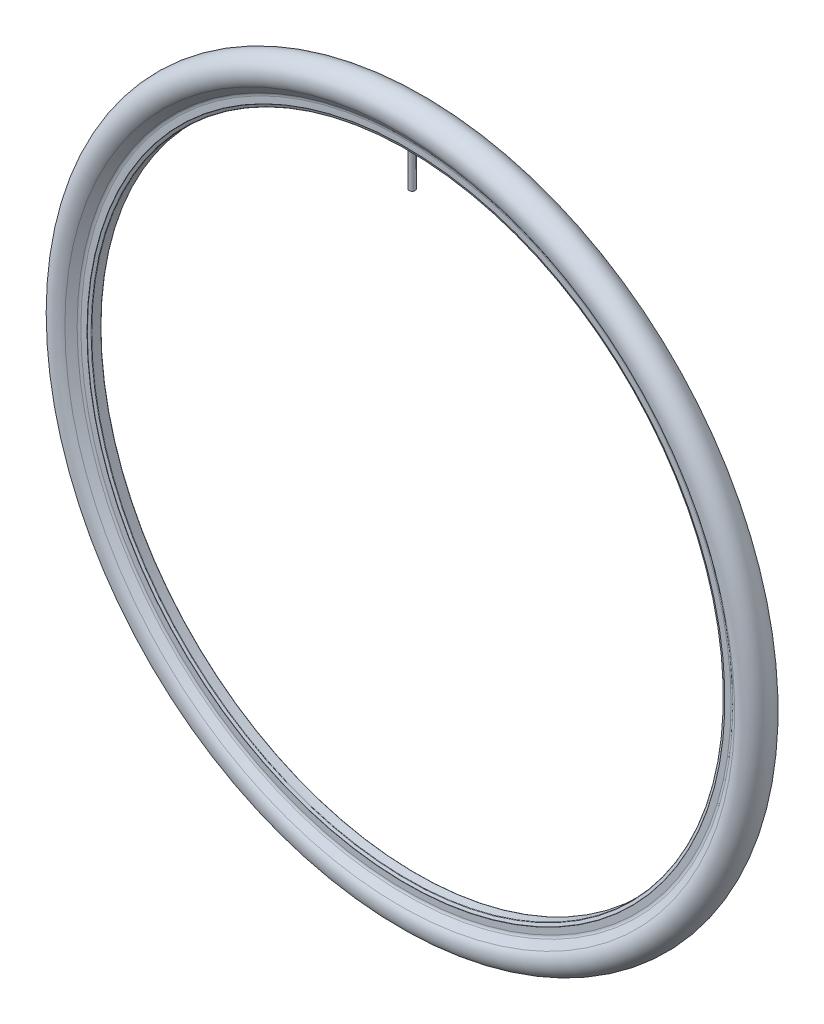
ISO-10303-21;
HEADER;
FILE_DESCRIPTION(('STEP AP214'),'2;1');
FILE_NAME('part.step','',(''),(''),'','','');
FILE_SCHEMA(('AUTOMOTIVE_DESIGN { 1 0 10303 214 1 1 1 1 }'));
ENDSEC;
DATA;
#1=APPLICATION_CONTEXT('core data for automotive mechanical design processes');
#2=APPLICATION_PROTOCOL_DEFINITION('international standard','automotive_design',2000,#1);
#3=PRODUCT_CONTEXT('',#1,'mechanical');
#4=PRODUCT('Part','Part','',(#3));
#5=PRODUCT_RELATED_PRODUCT_CATEGORY('part','',(#4));
#6=PRODUCT_DEFINITION_FORMATION('','',#4);
#7=PRODUCT_DEFINITION_CONTEXT('part definition',#1,'design');
#8=PRODUCT_DEFINITION('design','',#6,#7);
#9=PRODUCT_DEFINITION_SHAPE('','',#8);
#10=(LENGTH_UNIT() NAMED_UNIT(*) SI_UNIT(.MILLI.,.METRE.));
#11=(NAMED_UNIT(*) PLANE_ANGLE_UNIT() SI_UNIT($,.RADIAN.));
#12=(NAMED_UNIT(*) SI_UNIT($,.STERADIAN.) SOLID_ANGLE_UNIT());
#13=UNCERTAINTY_MEASURE_WITH_UNIT(LENGTH_MEASURE(1.E-05),#10,'distance_accuracy_value','');
#14=(GEOMETRIC_REPRESENTATION_CONTEXT(3) GLOBAL_UNCERTAINTY_ASSIGNED_CONTEXT((#13)) GLOBAL_UNIT_ASSIGNED_CONTEXT((#10,
#11,#12)) REPRESENTATION_CONTEXT('',''));
#15=CARTESIAN_POINT('',(0.,0.,0.));
#16=DIRECTION('',(0.,0.,1.));
#17=DIRECTION('',(1.,0.,0.));
#18=AXIS2_PLACEMENT_3D('',#15,#16,#17);
#19=CARTESIAN_POINT('',(0.,0.,-66.4924890033598));
#20=DIRECTION('',(0.,0.,-1.));
#21=DIRECTION('',(-1.,0.,0.));
#22=AXIS2_PLACEMENT_3D('',#19,#20,#21);
#23=CYLINDRICAL_SURFACE('',#22,307.);
#24=CARTESIAN_POINT('',(0.,0.,-4.33166751784149));
#25=DIRECTION('',(0.,0.,-1.));
#26=DIRECTION('',(-1.,0.,0.));
#27=AXIS2_PLACEMENT_3D('',#24,#25,#26);
#28=CIRCLE('',#27,307.);
#29=CARTESIAN_POINT('',(-307.,0.,-4.33166751784141));
#30=VERTEX_POINT('',#29);
#31=EDGE_CURVE('E51',#30,#30,#28,.T.);
#32=ORIENTED_EDGE('',*,*,#31,.T.);
#33=EDGE_LOOP('',(#32));
#34=FACE_BOUND('',#33,.T.);
#35=CARTESIAN_POINT('',(0.,0.,4.33166751784149));
#36=DIRECTION('',(0.,0.,-1.));
#37=DIRECTION('',(-1.,0.,0.));
#38=AXIS2_PLACEMENT_3D('',#35,#36,#37);
#39=CIRCLE('',#38,307.);
#40=CARTESIAN_POINT('',(-307.,0.,4.33166751784158));
#41=VERTEX_POINT('',#40);
#42=EDGE_CURVE('E54',#41,#41,#39,.T.);
#43=ORIENTED_EDGE('',*,*,#42,.F.);
#44=EDGE_LOOP('',(#43));
#45=FACE_BOUND('',#44,.T.);
#46=CARTESIAN_POINT('',(0.,307.,-3.00000000000002));
#47=CARTESIAN_POINT('',(0.168507000842233,306.999999801845,-2.99999252892106));
#48=CARTESIAN_POINT('',(0.337136082730728,306.999859774589,-2.98575505531126));
#49=CARTESIAN_POINT('',(0.669749817537958,306.999314639336,-2.92915668525447));
#50=CARTESIAN_POINT('',(0.833728637064352,306.998909212539,-2.8867619652389));
#51=CARTESIAN_POINT('',(1.15217499523825,306.997879204767,-2.77505636300819));
#52=CARTESIAN_POINT('',(1.30664704757053,306.997254728753,-2.70575837011928));
#53=CARTESIAN_POINT('',(1.60172126722541,306.995857116755,-2.54223112538406));
#54=CARTESIAN_POINT('',(1.74232686485481,306.995084017677,-2.44800806088959));
#55=CARTESIAN_POINT('',(2.00574570718094,306.993476097252,-2.23728296474041));
#56=CARTESIAN_POINT('',(2.12855655686106,306.992641267618,-2.12077793901606));
#57=CARTESIAN_POINT('',(2.35288046629823,306.991004053857,-1.86879875626503));
#58=CARTESIAN_POINT('',(2.45439268841956,306.990201671007,-1.73332385353736));
#59=CARTESIAN_POINT('',(2.63323219880829,306.98871985074,-1.44725361083283));
#60=CARTESIAN_POINT('',(2.71055945400305,306.988040413491,-1.2966582501793));
#61=CARTESIAN_POINT('',(2.83883318995256,306.986881094966,-0.984622373330269));
#62=CARTESIAN_POINT('',(2.88977972934464,306.986401213245,-0.823181881241517));
#63=CARTESIAN_POINT('',(2.96384455342325,306.985695125632,-0.494043519446182));
#64=CARTESIAN_POINT('',(2.98696368616211,306.985468912009,-0.326345840590682));
#65=CARTESIAN_POINT('',(3.00471999192295,306.985295641765,0.010550492687932));
#66=CARTESIAN_POINT('',(2.99935722288316,306.985348584576,0.17974914405705));
#67=CARTESIAN_POINT('',(2.96030281759654,306.985727649641,0.514838648767663));
#68=CARTESIAN_POINT('',(2.92661213896895,306.98605376266,0.680729613730767));
#69=CARTESIAN_POINT('',(2.83185972735208,306.986942387663,1.00450086450579));
#70=CARTESIAN_POINT('',(2.7707979621348,306.987504899924,1.16238114088532));
#71=CARTESIAN_POINT('',(2.62303563967011,306.988802915838,1.46565216865405));
#72=CARTESIAN_POINT('',(2.53633464535241,306.98953842244,1.61104270707697));
#73=CARTESIAN_POINT('',(2.33975540567853,306.991099501789,1.88520468322982));
#74=CARTESIAN_POINT('',(2.22987716308622,306.991925074526,2.01397612294157));
#75=CARTESIAN_POINT('',(1.990057027451,306.993573252124,2.25125018143944));
#76=CARTESIAN_POINT('',(1.86011429310443,306.994395856859,2.35975194989696));
#77=CARTESIAN_POINT('',(1.58385681343715,306.99594532371,2.55340009510425));
#78=CARTESIAN_POINT('',(1.43754206593101,306.996672185812,2.63854646873639));
#79=CARTESIAN_POINT('',(1.13269355382631,306.997948221289,2.78306665458129));
#80=CARTESIAN_POINT('',(0.974159777741514,306.998497394497,2.84244044256674));
#81=CARTESIAN_POINT('',(0.649373714481755,306.999356135141,2.93372948218667));
#82=CARTESIAN_POINT('',(0.483121429846189,306.999665702657,2.96564474285499));
#83=CARTESIAN_POINT('',(0.14762511577715,307.000010322336,3.00110971792454));
#84=CARTESIAN_POINT('',(-0.0216187896043762,307.000045385854,3.00466060574367));
#85=CARTESIAN_POINT('',(-0.358300498127618,306.999837074505,2.98329909141611));
#86=CARTESIAN_POINT('',(-0.52573830141839,306.999593699661,2.9583866916185));
#87=CARTESIAN_POINT('',(-0.854051487374667,306.998855956475,2.88080675771612));
#88=CARTESIAN_POINT('',(-1.01492699534501,306.998361592927,2.8281397538438));
#89=CARTESIAN_POINT('',(-1.3255526435439,306.997177605093,2.69654621550786));
#90=CARTESIAN_POINT('',(-1.47530278269038,306.996487980787,2.61761967849021));
#91=CARTESIAN_POINT('',(-1.75943215021837,306.994991186405,2.43574453892483));
#92=CARTESIAN_POINT('',(-1.89381087390591,306.994184012472,2.33279514796521));
#93=CARTESIAN_POINT('',(-2.14337778701596,306.992543130498,2.10579784037378));
#94=CARTESIAN_POINT('',(-2.25856596430501,306.991709422442,1.98174991040227));
#95=CARTESIAN_POINT('',(-2.46648581307417,306.990109433543,1.71607184045562));
#96=CARTESIAN_POINT('',(-2.55921672206267,306.98934315499,1.57444110373837));
#97=CARTESIAN_POINT('',(-2.71958439522835,306.98796445401,1.27762109125281));
#98=CARTESIAN_POINT('',(-2.78722118909606,306.987352031401,1.12243183152678));
#99=CARTESIAN_POINT('',(-2.89547940567963,306.98635010408,0.802902931610935));
#100=CARTESIAN_POINT('',(-2.93610133009404,306.985960595229,0.638563461412955));
#101=CARTESIAN_POINT('',(-2.98917836882683,306.985448397514,0.305396542807761));
#102=CARTESIAN_POINT('',(-3.00163344038945,306.985325709056,0.136569087588425));
#103=CARTESIAN_POINT('',(-2.99802303601633,306.985360987114,-0.200773177603706));
#104=CARTESIAN_POINT('',(-2.9819588012451,306.985518941417,-0.369288000862793));
#105=CARTESIAN_POINT('',(-2.92176826202349,306.986097671924,-0.701229052921147));
#106=CARTESIAN_POINT('',(-2.87764190121483,306.986518448657,-0.864655271500075));
#107=CARTESIAN_POINT('',(-2.76257897221019,306.987575392849,-1.18178273122479));
#108=CARTESIAN_POINT('',(-2.69164190709221,306.988211564299,-1.33548379205836));
#109=CARTESIAN_POINT('',(-2.52497435541301,306.989627542961,-1.6287892672019));
#110=CARTESIAN_POINT('',(-2.42924483419874,306.99040734458,-1.76839423007929));
#111=CARTESIAN_POINT('',(-2.21571651178069,306.992022643525,-2.0295439071572));
#112=CARTESIAN_POINT('',(-2.09791910047104,306.992858137341,-2.15108975790438));
#113=CARTESIAN_POINT('',(-1.84355621277508,306.99449089547,-2.37271089580679));
#114=CARTESIAN_POINT('',(-1.70698608075206,306.995288150232,-2.47278084111817));
#115=CARTESIAN_POINT('',(-1.41892760124024,306.996754683911,-2.64861190622085));
#116=CARTESIAN_POINT('',(-1.26743189521152,306.997423899218,-2.72436095626323));
#117=CARTESIAN_POINT('',(-0.953991482699,306.998557584721,-2.84926248733127));
#118=CARTESIAN_POINT('',(-0.792059557634327,306.999022300107,-2.89844683492538));
#119=CARTESIAN_POINT('',(-0.524247157695177,306.999569777841,-2.95572196604833));
#120=CARTESIAN_POINT('',(-0.420106675529563,306.999730415627,-2.97230548832878));
#121=CARTESIAN_POINT('',(-0.210660036027182,306.999945588649,-2.99444684066841));
#122=CARTESIAN_POINT('',(-0.105353878726085,307.00000012389,-3.00000467106497));
#123=CARTESIAN_POINT('',(0.,307.,-3.00000000000002));
#124=B_SPLINE_CURVE_WITH_KNOTS('',3,(#46,#47,#48,#49,#50,#51,#52,#53,#54,#55,#56,#57,#58,#59,
#60,#61,#62,#63,#64,#65,#66,#67,#68,#69,#70,#71,#72,#73,#74,#75,#76,#77,#78,#79,#80,#81,#82,#83,
#84,#85,#86,#87,#88,#89,#90,#91,#92,#93,#94,#95,#96,#97,#98,#99,#100,#101,#102,#103,#104,#105,
#106,#107,#108,#109,#110,#111,#112,#113,#114,#115,#116,#117,#118,#119,#120,#121,#122,#123),
.UNSPECIFIED.,.T.,.F.,(4,2,2,2,2,2,2,2,2,2,2,2,2,2,2,2,2,2,2,2,2,2,2,2,2,2,2,2,2,2,2,2,2,2,2,2,
2,2,4),(0.,0.505136459677329,1.0108808088398,1.51638315490702,2.02176013360832,2.52720506855076,
3.0326698779849,3.53813537863296,4.04359975576058,4.54904872825118,5.05449667255192,
5.55992753097419,6.06535898451571,6.57079905461123,7.07623906443318,7.58170027310049,
8.08716154923973,8.59262330053259,9.09808488552897,9.6035255597599,10.1089661922765,
10.6143971690509,11.1198281949842,11.6252758111149,12.1307237468197,12.6361888415922,
13.1416533383128,13.6471084476883,14.1525643243166,14.6579982039684,15.1634330987064,
15.6688773618678,16.1743019474413,16.6796947107323,17.1852130383767,17.6909818535975,
18.1961426019142,18.511963824032,18.8277850364859),.UNSPECIFIED.);
#125=CARTESIAN_POINT('',(0.,307.,-3.00000000000002));
#126=VERTEX_POINT('',#125);
#127=EDGE_CURVE('E10',#126,#126,#124,.T.);
#128=ORIENTED_EDGE('',*,*,#127,.F.);
#129=EDGE_LOOP('',(#128));
#130=FACE_BOUND('',#129,.T.);
#131=ADVANCED_FACE('F24',(#34,#45,#130),#23,.F.);
#132=CARTESIAN_POINT('',(0.,0.,-10.5));
#133=DIRECTION('',(0.,0.,-1.));
#134=DIRECTION('',(-1.,0.,0.));
#135=AXIS2_PLACEMENT_3D('',#132,#133,#134);
#136=TOROIDAL_SURFACE('',#135,316.000025307462,4.5);
#137=CARTESIAN_POINT('',(0.,0.,-6.00000000000001));
#138=DIRECTION('',(0.,0.,-1.));
#139=DIRECTION('',(-1.,0.,0.));
#140=AXIS2_PLACEMENT_3D('',#137,#138,#139);
#141=CIRCLE('',#140,316.000025307462);
#142=CARTESIAN_POINT('',(-316.000025307462,0.,-5.99999999999992));
#143=VERTEX_POINT('',#142);
#144=EDGE_CURVE('E35',#143,#143,#141,.T.);
#145=ORIENTED_EDGE('',*,*,#144,.F.);
#146=EDGE_LOOP('',(#145));
#147=FACE_BOUND('',#146,.T.);
#148=CARTESIAN_POINT('',(0.,0.,-6.90000482333175));
#149=DIRECTION('',(0.,0.,-1.));
#150=DIRECTION('',(-1.,0.,0.));
#151=AXIS2_PLACEMENT_3D('',#148,#149,#150);
#152=CIRCLE('',#151,318.700031738559);
#153=CARTESIAN_POINT('',(-318.700031738559,0.,-6.90000482333167));
#154=VERTEX_POINT('',#153);
#155=EDGE_CURVE('E78',#154,#154,#152,.T.);
#156=ORIENTED_EDGE('',*,*,#155,.T.);
#157=EDGE_LOOP('',(#156));
#158=FACE_BOUND('',#157,.T.);
#159=ADVANCED_FACE('F26',(#147,#158),#136,.F.);
#160=CARTESIAN_POINT('',(0.,316.000025307462,-6.00000000000002));
#161=DIRECTION('',(0.,0.,1.));
#162=DIRECTION('',(1.,0.,0.));
#163=AXIS2_PLACEMENT_3D('',#160,#161,#162);
#164=PLANE('',#163);
#165=CARTESIAN_POINT('',(0.,0.,-6.00000000000001));
#166=DIRECTION('',(0.,0.,-1.));
#167=DIRECTION('',(-1.,0.,0.));
#168=AXIS2_PLACEMENT_3D('',#165,#166,#167);
#169=CIRCLE('',#168,310.);
#170=CARTESIAN_POINT('',(-310.,0.,-5.99999999999992));
#171=VERTEX_POINT('',#170);
#172=EDGE_CURVE('E39',#171,#171,#169,.T.);
#173=ORIENTED_EDGE('',*,*,#172,.F.);
#174=EDGE_LOOP('',(#173));
#175=FACE_BOUND('',#174,.T.);
#176=ORIENTED_EDGE('',*,*,#144,.T.);
#177=EDGE_LOOP('',(#176));
#178=FACE_BOUND('',#177,.T.);
#179=ADVANCED_FACE('F249',(#175,#178),#164,.F.);
#180=CARTESIAN_POINT('',(0.,0.,-6.28570153765407));
#181=DIRECTION('',(0.,0.,-1.));
#182=DIRECTION('',(-1.,0.,0.));
#183=AXIS2_PLACEMENT_3D('',#180,#181,#182);
#184=TOROIDAL_SURFACE('',#183,309.58966522036,0.500000000000036);
#185=CARTESIAN_POINT('',(0.,0.,-5.82416352940557));
#186=DIRECTION('',(0.,0.,-1.));
#187=DIRECTION('',(-1.,0.,0.));
#188=AXIS2_PLACEMENT_3D('',#185,#186,#187);
#189=CIRCLE('',#188,309.78197400056);
#190=CARTESIAN_POINT('',(-309.78197400056,0.,-5.82416352940548));
#191=VERTEX_POINT('',#190);
#192=EDGE_CURVE('E43',#191,#191,#189,.T.);
#193=ORIENTED_EDGE('',*,*,#192,.F.);
#194=EDGE_LOOP('',(#193));
#195=FACE_BOUND('',#194,.T.);
#196=ORIENTED_EDGE('',*,*,#172,.T.);
#197=EDGE_LOOP('',(#196));
#198=FACE_BOUND('',#197,.T.);
#199=ADVANCED_FACE('F246',(#195,#198),#184,.F.);
#200=CARTESIAN_POINT('',(0.,0.,-5.82416352940557));
#201=DIRECTION('',(0.,0.,-1.));
#202=DIRECTION('',(-1.,0.,0.));
#203=AXIS2_PLACEMENT_3D('',#200,#201,#202);
#204=CONICAL_SURFACE('',#203,309.78197400056,1.17600284999378);
#205=CARTESIAN_POINT('',(0.,0.,-4.79320552608995));
#206=DIRECTION('',(0.,0.,-1.));
#207=DIRECTION('',(-1.,0.,0.));
#208=AXIS2_PLACEMENT_3D('',#205,#206,#207);
#209=CIRCLE('',#208,307.3076912198);
#210=CARTESIAN_POINT('',(-307.3076912198,0.,-4.79320552608987));
#211=VERTEX_POINT('',#210);
#212=EDGE_CURVE('E48',#211,#211,#209,.T.);
#213=ORIENTED_EDGE('',*,*,#212,.F.);
#214=EDGE_LOOP('',(#213));
#215=FACE_BOUND('',#214,.T.);
#216=ORIENTED_EDGE('',*,*,#192,.T.);
#217=EDGE_LOOP('',(#216));
#218=FACE_BOUND('',#217,.T.);
#219=ADVANCED_FACE('F242',(#215,#218),#204,.F.);
#220=CARTESIAN_POINT('',(0.,0.,-4.33166751784149));
#221=DIRECTION('',(0.,0.,-1.));
#222=DIRECTION('',(-1.,0.,0.));
#223=AXIS2_PLACEMENT_3D('',#220,#221,#222);
#224=TOROIDAL_SURFACE('',#223,307.5,0.500000000000002);
#225=ORIENTED_EDGE('',*,*,#31,.F.);
#226=EDGE_LOOP('',(#225));
#227=FACE_BOUND('',#226,.T.);
#228=ORIENTED_EDGE('',*,*,#212,.T.);
#229=EDGE_LOOP('',(#228));
#230=FACE_BOUND('',#229,.T.);
#231=ADVANCED_FACE('F234',(#227,#230),#224,.T.);
#232=CARTESIAN_POINT('',(0.,0.,4.33166751784149));
#233=DIRECTION('',(0.,0.,-1.));
#234=DIRECTION('',(-1.,0.,0.));
#235=AXIS2_PLACEMENT_3D('',#232,#233,#234);
#236=TOROIDAL_SURFACE('',#235,307.5,0.500000000000003);
#237=CARTESIAN_POINT('',(0.,0.,4.79320552608995));
#238=DIRECTION('',(0.,0.,-1.));
#239=DIRECTION('',(-1.,0.,0.));
#240=AXIS2_PLACEMENT_3D('',#237,#238,#239);
#241=CIRCLE('',#240,307.3076912198);
#242=CARTESIAN_POINT('',(-307.3076912198,0.,4.79320552609003));
#243=VERTEX_POINT('',#242);
#244=EDGE_CURVE('E57',#243,#243,#241,.T.);
#245=ORIENTED_EDGE('',*,*,#244,.F.);
#246=EDGE_LOOP('',(#245));
#247=FACE_BOUND('',#246,.T.);
#248=ORIENTED_EDGE('',*,*,#42,.T.);
#249=EDGE_LOOP('',(#248));
#250=FACE_BOUND('',#249,.T.);
#251=ADVANCED_FACE('F231',(#247,#250),#236,.T.);
#252=CARTESIAN_POINT('',(0.,0.,4.79320552608995));
#253=DIRECTION('',(0.,0.,1.));
#254=DIRECTION('',(1.,0.,0.));
#255=AXIS2_PLACEMENT_3D('',#252,#253,#254);
#256=CONICAL_SURFACE('',#255,307.3076912198,1.17600284999378);
#257=CARTESIAN_POINT('',(0.,0.,5.82416352940557));
#258=DIRECTION('',(0.,0.,-1.));
#259=DIRECTION('',(-1.,0.,0.));
#260=AXIS2_PLACEMENT_3D('',#257,#258,#259);
#261=CIRCLE('',#260,309.78197400056);
#262=CARTESIAN_POINT('',(-309.78197400056,0.,5.82416352940566));
#263=VERTEX_POINT('',#262);
#264=EDGE_CURVE('E60',#263,#263,#261,.T.);
#265=ORIENTED_EDGE('',*,*,#264,.F.);
#266=EDGE_LOOP('',(#265));
#267=FACE_BOUND('',#266,.T.);
#268=ORIENTED_EDGE('',*,*,#244,.T.);
#269=EDGE_LOOP('',(#268));
#270=FACE_BOUND('',#269,.T.);
#271=ADVANCED_FACE('F227',(#267,#270),#256,.F.);
#272=CARTESIAN_POINT('',(0.,0.,6.28570153765406));
#273=DIRECTION('',(0.,0.,-1.));
#274=DIRECTION('',(-1.,0.,0.));
#275=AXIS2_PLACEMENT_3D('',#272,#273,#274);
#276=TOROIDAL_SURFACE('',#275,309.58966522036,0.500000000000036);
#277=CARTESIAN_POINT('',(0.,0.,6.00000000000002));
#278=DIRECTION('',(0.,0.,-1.));
#279=DIRECTION('',(-1.,0.,0.));
#280=AXIS2_PLACEMENT_3D('',#277,#278,#279);
#281=CIRCLE('',#280,310.);
#282=CARTESIAN_POINT('',(-310.,0.,6.0000000000001));
#283=VERTEX_POINT('',#282);
#284=EDGE_CURVE('E63',#283,#283,#281,.T.);
#285=ORIENTED_EDGE('',*,*,#284,.F.);
#286=EDGE_LOOP('',(#285));
#287=FACE_BOUND('',#286,.T.);
#288=ORIENTED_EDGE('',*,*,#264,.T.);
#289=EDGE_LOOP('',(#288));
#290=FACE_BOUND('',#289,.T.);
#291=ADVANCED_FACE('F223',(#287,#290),#276,.F.);
#292=CARTESIAN_POINT('',(0.,316.000025307462,6.));
#293=DIRECTION('',(0.,0.,-1.));
#294=DIRECTION('',(-1.,0.,0.));
#295=AXIS2_PLACEMENT_3D('',#292,#293,#294);
#296=PLANE('',#295);
#297=CARTESIAN_POINT('',(0.,0.,6.00000000000002));
#298=DIRECTION('',(0.,0.,-1.));
#299=DIRECTION('',(-1.,0.,0.));
#300=AXIS2_PLACEMENT_3D('',#297,#298,#299);
#301=CIRCLE('',#300,316.000025307462);
#302=CARTESIAN_POINT('',(-316.000025307462,0.,6.0000000000001));
#303=VERTEX_POINT('',#302);
#304=EDGE_CURVE('E66',#303,#303,#301,.T.);
#305=ORIENTED_EDGE('',*,*,#304,.F.);
#306=EDGE_LOOP('',(#305));
#307=FACE_BOUND('',#306,.T.);
#308=ORIENTED_EDGE('',*,*,#284,.T.);
#309=EDGE_LOOP('',(#308));
#310=FACE_BOUND('',#309,.T.);
#311=ADVANCED_FACE('F219',(#307,#310),#296,.F.);
#312=CARTESIAN_POINT('',(0.,0.,10.5));
#313=DIRECTION('',(0.,0.,-1.));
#314=DIRECTION('',(-1.,0.,0.));
#315=AXIS2_PLACEMENT_3D('',#312,#313,#314);
#316=TOROIDAL_SURFACE('',#315,316.000025307462,4.5);
#317=CARTESIAN_POINT('',(0.,0.,6.90000482333176));
#318=DIRECTION('',(0.,0.,-1.));
#319=DIRECTION('',(-1.,0.,0.));
#320=AXIS2_PLACEMENT_3D('',#317,#318,#319);
#321=CIRCLE('',#320,318.700031738559);
#322=CARTESIAN_POINT('',(-318.700031738559,0.,6.90000482333185));
#323=VERTEX_POINT('',#322);
#324=EDGE_CURVE('E69',#323,#323,#321,.T.);
#325=ORIENTED_EDGE('',*,*,#324,.F.);
#326=EDGE_LOOP('',(#325));
#327=FACE_BOUND('',#326,.T.);
#328=ORIENTED_EDGE('',*,*,#304,.T.);
#329=EDGE_LOOP('',(#328));
#330=FACE_BOUND('',#329,.T.);
#331=ADVANCED_FACE('F215',(#327,#330),#316,.F.);
#332=CARTESIAN_POINT('',(0.,0.,6.90000482333176));
#333=DIRECTION('',(0.,0.,1.));
#334=DIRECTION('',(1.,0.,0.));
#335=AXIS2_PLACEMENT_3D('',#332,#333,#334);
#336=CONICAL_SURFACE('',#335,318.700031738559,0.927293431584578);
#337=CARTESIAN_POINT('',(0.,0.,11.9999839222276));
#338=DIRECTION('',(0.,0.,-1.));
#339=DIRECTION('',(-1.,0.,0.));
#340=AXIS2_PLACEMENT_3D('',#337,#338,#339);
#341=CIRCLE('',#340,325.49997856301);
#342=CARTESIAN_POINT('',(-325.49997856301,0.,11.9999839222277));
#343=VERTEX_POINT('',#342);
#344=EDGE_CURVE('E72',#343,#343,#341,.T.);
#345=ORIENTED_EDGE('',*,*,#344,.F.);
#346=EDGE_LOOP('',(#345));
#347=FACE_BOUND('',#346,.T.);
#348=ORIENTED_EDGE('',*,*,#324,.T.);
#349=EDGE_LOOP('',(#348));
#350=FACE_BOUND('',#349,.T.);
#351=ADVANCED_FACE('F211',(#347,#350),#336,.F.);
#352=CARTESIAN_POINT('',(0.,0.,0.));
#353=DIRECTION('',(0.,0.,-1.));
#354=DIRECTION('',(-1.,0.,0.));
#355=AXIS2_PLACEMENT_3D('',#352,#353,#354);
#356=TOROIDAL_SURFACE('',#355,334.5,15.);
#357=CARTESIAN_POINT('',(0.,0.,-11.9999839222276));
#358=DIRECTION('',(0.,0.,-1.));
#359=DIRECTION('',(-1.,0.,0.));
#360=AXIS2_PLACEMENT_3D('',#357,#358,#359);
#361=CIRCLE('',#360,325.49997856301);
#362=CARTESIAN_POINT('',(-325.49997856301,0.,-11.9999839222275));
#363=VERTEX_POINT('',#362);
#364=EDGE_CURVE('E75',#363,#363,#361,.T.);
#365=ORIENTED_EDGE('',*,*,#364,.F.);
#366=EDGE_LOOP('',(#365));
#367=FACE_BOUND('',#366,.T.);
#368=ORIENTED_EDGE('',*,*,#344,.T.);
#369=EDGE_LOOP('',(#368));
#370=FACE_BOUND('',#369,.T.);
#371=ADVANCED_FACE('F207',(#367,#370),#356,.T.);
#372=CARTESIAN_POINT('',(0.,0.,-11.9999839222276));
#373=DIRECTION('',(0.,0.,-1.));
#374=DIRECTION('',(-1.,0.,0.));
#375=AXIS2_PLACEMENT_3D('',#372,#373,#374);
#376=CONICAL_SURFACE('',#375,325.49997856301,0.927293431584579);
#377=ORIENTED_EDGE('',*,*,#155,.F.);
#378=EDGE_LOOP('',(#377));
#379=FACE_BOUND('',#378,.T.);
#380=ORIENTED_EDGE('',*,*,#364,.T.);
#381=EDGE_LOOP('',(#380));
#382=FACE_BOUND('',#381,.T.);
#383=ADVANCED_FACE('F145',(#379,#382),#376,.F.);
#384=CARTESIAN_POINT('',(-2.1316282072803E-11,500000.,-1.47325332827059E-11));
#385=DIRECTION('',(0.,-1.,0.));
#386=DIRECTION('',(0.,0.,-1.));
#387=AXIS2_PLACEMENT_3D('',#384,#385,#386);
#388=CYLINDRICAL_SURFACE('',#387,3.);
#389=CARTESIAN_POINT('',(0.,272.,0.));
#390=DIRECTION('',(0.,1.,0.));
#391=DIRECTION('',(0.,0.,1.));
#392=AXIS2_PLACEMENT_3D('',#389,#390,#391);
#393=CIRCLE('',#392,3.);
#394=CARTESIAN_POINT('',(0.,272.,3.));
#395=VERTEX_POINT('',#394);
#396=EDGE_CURVE('E123',#395,#395,#393,.T.);
#397=ORIENTED_EDGE('',*,*,#396,.T.);
#398=EDGE_LOOP('',(#397));
#399=FACE_BOUND('',#398,.T.);
#400=ORIENTED_EDGE('',*,*,#127,.T.);
#401=EDGE_LOOP('',(#400));
#402=FACE_BOUND('',#401,.T.);
#403=ADVANCED_FACE('F142',(#399,#402),#388,.T.);
#404=CARTESIAN_POINT('',(0.,272.,0.));
#405=DIRECTION('',(0.,1.,0.));
#406=DIRECTION('',(0.,0.,1.));
#407=AXIS2_PLACEMENT_3D('',#404,#405,#406);
#408=PLANE('',#407);
#409=CARTESIAN_POINT('',(0.,272.,0.));
#410=DIRECTION('',(0.,-1.,0.));
#411=DIRECTION('',(0.,0.,-1.));
#412=AXIS2_PLACEMENT_3D('',#409,#410,#411);
#413=CIRCLE('',#412,1.25);
#414=CARTESIAN_POINT('',(0.,272.,-1.25000000000001));
#415=VERTEX_POINT('',#414);
#416=EDGE_CURVE('E126',#415,#415,#413,.T.);
#417=ORIENTED_EDGE('',*,*,#416,.F.);
#418=EDGE_LOOP('',(#417));
#419=FACE_BOUND('',#418,.T.);
#420=ORIENTED_EDGE('',*,*,#396,.F.);
#421=EDGE_LOOP('',(#420));
#422=FACE_BOUND('',#421,.T.);
#423=ADVANCED_FACE('F140',(#419,#422),#408,.F.);
#424=CARTESIAN_POINT('',(0.,349.501,0.));
#425=DIRECTION('',(0.,-1.,0.));
#426=DIRECTION('',(0.,0.,-1.));
#427=AXIS2_PLACEMENT_3D('',#424,#425,#426);
#428=CYLINDRICAL_SURFACE('',#427,1.25);
#429=CARTESIAN_POINT('',(0.,308.,-1.25000000000001));
#430=CARTESIAN_POINT('',(0.0702127385317013,307.999999965699,-1.24999688654886));
#431=CARTESIAN_POINT('',(0.140476380543123,307.999975733302,-1.24406435537686));
#432=CARTESIAN_POINT('',(0.279068545905202,307.999881395,-1.22048064819932));
#433=CARTESIAN_POINT('',(0.347394637054271,307.999811233887,-1.20281536896771));
#434=CARTESIAN_POINT('',(0.480083793701973,307.999632986193,-1.15626908265799));
#435=CARTESIAN_POINT('',(0.544448735947087,307.999524917736,-1.12739343506155));
#436=CARTESIAN_POINT('',(0.667399186741499,307.999283055632,-1.05925345279601));
#437=CARTESIAN_POINT('',(0.725986126956944,307.999149268381,-1.01999170050607));
#438=CARTESIAN_POINT('',(0.835744597174723,307.99887101833,-0.932185838885144));
#439=CARTESIAN_POINT('',(0.886915312360926,307.998726554359,-0.88364071095232));
#440=CARTESIAN_POINT('',(0.98038232210852,307.998443243969,-0.77864673239764));
#441=CARTESIAN_POINT('',(1.02267826806949,307.998304397771,-0.722197571450977));
#442=CARTESIAN_POINT('',(1.09719212107298,307.998047985531,-0.603000350837894));
#443=CARTESIAN_POINT('',(1.12941018106294,307.997930419167,-0.540252386784594));
#444=CARTESIAN_POINT('',(1.18285443607574,307.997729819073,-0.410238191984331));
#445=CARTESIAN_POINT('',(1.20408065360331,307.997646785273,-0.342971970488381));
#446=CARTESIAN_POINT('',(1.2349386995335,307.99752461187,-0.205830903979374));
#447=CARTESIAN_POINT('',(1.24457057059695,307.997485472105,-0.135956068565561));
#448=CARTESIAN_POINT('',(1.25196661885165,307.99745549906,0.00441876701186247));
#449=CARTESIAN_POINT('',(1.24973081790341,307.99746466569,0.0749187660236689));
#450=CARTESIAN_POINT('',(1.2334550909148,307.99753027156,0.214542357871582));
#451=CARTESIAN_POINT('',(1.21941523004731,307.99758671054,0.28366595830494));
#452=CARTESIAN_POINT('',(1.17993001382588,307.997740497717,0.418575026473765));
#453=CARTESIAN_POINT('',(1.15448464619213,307.99783784596,0.484360490615122));
#454=CARTESIAN_POINT('',(1.09291066278587,307.998062476701,0.61072595582813));
#455=CARTESIAN_POINT('',(1.05678201847178,307.99818975928,0.671305942992204));
#456=CARTESIAN_POINT('',(0.974867104761046,307.998459908432,0.785540596649894));
#457=CARTESIAN_POINT('',(0.929080838797953,307.998602775,0.839195265605646));
#458=CARTESIAN_POINT('',(0.829150009142825,307.998887986355,0.938056625756273));
#459=CARTESIAN_POINT('',(0.775005384042411,307.999030331139,0.983263254878496));
#460=CARTESIAN_POINT('',(0.659895052034745,307.999298449663,1.06394478011586));
#461=CARTESIAN_POINT('',(0.598929344232832,307.999424223401,1.09941967495458));
#462=CARTESIAN_POINT('',(0.471907458841066,307.999645019841,1.1596306877382));
#463=CARTESIAN_POINT('',(0.405851280610978,307.999740042539,1.18436680433247));
#464=CARTESIAN_POINT('',(0.270523609948364,307.999888623752,1.2223980382354));
#465=CARTESIAN_POINT('',(0.201252117818167,307.999942182272,1.23569315661983));
#466=CARTESIAN_POINT('',(0.0614607594521538,308.000001796576,1.25046491239278));
#467=CARTESIAN_POINT('',(-0.00905909787154783,308.000007852699,1.25194163411908));
#468=CARTESIAN_POINT('',(-0.14934580436627,307.999971780325,1.24303489622082));
#469=CARTESIAN_POINT('',(-0.219112653519934,307.999929651827,1.2326514363229));
#470=CARTESIAN_POINT('',(-0.355912634020158,307.999801960061,1.20031915920214));
#471=CARTESIAN_POINT('',(-0.422945774274666,307.999716396934,1.17837037966881));
#472=CARTESIAN_POINT('',(-0.552375728972349,307.999511482425,1.1235305663547));
#473=CARTESIAN_POINT('',(-0.614772543839062,307.999392131045,1.09063953357351));
#474=CARTESIAN_POINT('',(-0.733158976964941,307.999133094962,1.01484867946003));
#475=CARTESIAN_POINT('',(-0.789148559665462,307.998993410145,0.971948802585007));
#476=CARTESIAN_POINT('',(-0.893130815087144,307.99870945579,0.87735812307173));
#477=CARTESIAN_POINT('',(-0.941123484257624,307.99856518625,0.825667316530269));
#478=CARTESIAN_POINT('',(-1.02774980918403,307.998288326781,0.714961760948259));
#479=CARTESIAN_POINT('',(-1.06638340762544,307.998155736922,0.655946967059292));
#480=CARTESIAN_POINT('',(-1.13319447029991,307.99791718657,0.532268989297746));
#481=CARTESIAN_POINT('',(-1.16137194580098,307.997811226047,0.467605811512224));
#482=CARTESIAN_POINT('',(-1.20647084103452,307.997637880954,0.334466839081999));
#483=CARTESIAN_POINT('',(-1.22339230032041,307.997570496249,0.26599105783563));
#484=CARTESIAN_POINT('',(-1.24549896510498,307.997481899407,0.127170384203486));
#485=CARTESIAN_POINT('',(-1.25068415003011,307.997460687353,0.0568254885413943));
#486=CARTESIAN_POINT('',(-1.24917101351729,307.997466827608,-0.0837357335407452));
#487=CARTESIAN_POINT('',(-1.24247280002026,307.997494179477,-0.153952061122821));
#488=CARTESIAN_POINT('',(-1.21738319144352,307.997594363044,-0.292263695277393));
#489=CARTESIAN_POINT('',(-1.1989917728553,307.997667194833,-0.360358997585401));
#490=CARTESIAN_POINT('',(-1.15103742749409,307.997850128757,-0.49249665110788));
#491=CARTESIAN_POINT('',(-1.12147429280522,307.997960231584,-0.556538926865912));
#492=CARTESIAN_POINT('',(-1.05201698344458,307.99820528869,-0.678748761116204));
#493=CARTESIAN_POINT('',(-1.01212321383771,307.998340241993,-0.736916549823222));
#494=CARTESIAN_POINT('',(-0.923141509496595,307.998619775223,-0.845723791698562));
#495=CARTESIAN_POINT('',(-0.874054471048682,307.99876435421,-0.896363977898578));
#496=CARTESIAN_POINT('',(-0.768061084692741,307.99904688906,-0.988697427333148));
#497=CARTESIAN_POINT('',(-0.711152796466715,307.999184843268,-1.03038846384149));
#498=CARTESIAN_POINT('',(-0.591122208879634,307.999438596598,-1.10364054574243));
#499=CARTESIAN_POINT('',(-0.527996936127069,307.999554385039,-1.13519671289589));
#500=CARTESIAN_POINT('',(-0.397393974714525,307.999750526667,-1.18722695260845));
#501=CARTESIAN_POINT('',(-0.329921612565953,307.999830922308,-1.20771430930322));
#502=CARTESIAN_POINT('',(-0.218349429165865,307.999925610513,-1.23156560061917));
#503=CARTESIAN_POINT('',(-0.174974565173445,307.999953386384,-1.23846987166));
#504=CARTESIAN_POINT('',(-0.0877397612276519,307.999990591846,-1.24768804422219));
#505=CARTESIAN_POINT('',(-0.0438798212768341,308.000000021437,-1.25000194576773));
#506=CARTESIAN_POINT('',(0.,308.,-1.25000000000001));
#507=B_SPLINE_CURVE_WITH_KNOTS('',3,(#429,#430,#431,#432,#433,#434,#435,#436,#437,#438,#439,
#440,#441,#442,#443,#444,#445,#446,#447,#448,#449,#450,#451,#452,#453,#454,#455,#456,#457,#458,
#459,#460,#461,#462,#463,#464,#465,#466,#467,#468,#469,#470,#471,#472,#473,#474,#475,#476,#477,
#478,#479,#480,#481,#482,#483,#484,#485,#486,#487,#488,#489,#490,#491,#492,#493,#494,#495,#496,
#497,#498,#499,#500,#501,#502,#503,#504,#505,#506),.UNSPECIFIED.,.T.,.F.,(4,2,2,2,2,2,2,2,2,2,2,
2,2,2,2,2,2,2,2,2,2,2,2,2,2,2,2,2,2,2,2,2,2,2,2,2,2,2,4),(0.,0.210478054257761,
0.421209570445066,0.631840463387211,0.842419034651784,1.05302072454527,1.26363068531306,
1.47423744959559,1.68484378267952,1.89544934084531,2.10605451107131,2.31665851850609,
2.52726275268963,2.7378675495313,2.94847227149716,3.15907854083735,3.36968483780093,
3.58029116125275,3.79089746490177,4.0015022656324,4.21210707121724,4.42271119047933,
4.63331529050226,4.84392055927214,5.05452592155184,5.26513257353662,5.47573899856111,
5.68634468351457,5.89695073765688,6.1075548788031,6.3181594433582,6.52876792765043,
6.73936815521991,6.94994786126009,7.16057990313348,7.37131317757818,7.5817929773401,
7.71333234819081,7.84487171834872),.UNSPECIFIED.);
#508=CARTESIAN_POINT('',(0.,308.,-1.25000000000001));
#509=VERTEX_POINT('',#508);
#510=EDGE_CURVE('E127',#509,#509,#507,.T.);
#511=ORIENTED_EDGE('',*,*,#510,.F.);
#512=EDGE_LOOP('',(#511));
#513=FACE_BOUND('',#512,.T.);
#514=ORIENTED_EDGE('',*,*,#416,.T.);
#515=EDGE_LOOP('',(#514));
#516=FACE_BOUND('',#515,.T.);
#517=ADVANCED_FACE('F134',(#513,#516),#428,.F.);
#518=CARTESIAN_POINT('',(0.,0.,0.));
#519=DIRECTION('',(0.,0.,-1.));
#520=DIRECTION('',(-1.,0.,0.));
#521=AXIS2_PLACEMENT_3D('',#518,#519,#520);
#522=TOROIDAL_SURFACE('',#521,334.5,14.);
#523=CARTESIAN_POINT('',(0.,0.,-11.1999849940791));
#524=DIRECTION('',(0.,0.,-1.));
#525=DIRECTION('',(-1.,0.,0.));
#526=AXIS2_PLACEMENT_3D('',#523,#524,#525);
#527=CIRCLE('',#526,326.099979992143);
#528=CARTESIAN_POINT('',(-326.099979992143,0.,-11.199984994079));
#529=VERTEX_POINT('',#528);
#530=EDGE_CURVE('E120',#529,#529,#527,.T.);
#531=ORIENTED_EDGE('',*,*,#530,.T.);
#532=EDGE_LOOP('',(#531));
#533=FACE_BOUND('',#532,.T.);
#534=CARTESIAN_POINT('',(0.,0.,11.1999849940791));
#535=DIRECTION('',(0.,0.,-1.));
#536=DIRECTION('',(-1.,0.,0.));
#537=AXIS2_PLACEMENT_3D('',#534,#535,#536);
#538=CIRCLE('',#537,326.099979992143);
#539=CARTESIAN_POINT('',(-326.099979992143,0.,11.1999849940792));
#540=VERTEX_POINT('',#539);
#541=EDGE_CURVE('E81',#540,#540,#538,.T.);
#542=ORIENTED_EDGE('',*,*,#541,.F.);
#543=EDGE_LOOP('',(#542));
#544=FACE_BOUND('',#543,.T.);
#545=ADVANCED_FACE('F139',(#533,#544),#522,.F.);
#546=CARTESIAN_POINT('',(0.,0.,6.10000589518326));
#547=DIRECTION('',(0.,0.,1.));
#548=DIRECTION('',(1.,0.,0.));
#549=AXIS2_PLACEMENT_3D('',#546,#547,#548);
#550=CONICAL_SURFACE('',#549,319.300033167692,0.927293431584577);
#551=ORIENTED_EDGE('',*,*,#541,.T.);
#552=EDGE_LOOP('',(#551));
#553=FACE_BOUND('',#552,.T.);
#554=CARTESIAN_POINT('',(0.,0.,6.10000589518326));
#555=DIRECTION('',(0.,0.,-1.));
#556=DIRECTION('',(-1.,0.,0.));
#557=AXIS2_PLACEMENT_3D('',#554,#555,#556);
#558=CIRCLE('',#557,319.300033167692);
#559=CARTESIAN_POINT('',(-319.300033167692,0.,6.10000589518335));
#560=VERTEX_POINT('',#559);
#561=EDGE_CURVE('E84',#560,#560,#558,.T.);
#562=ORIENTED_EDGE('',*,*,#561,.F.);
#563=EDGE_LOOP('',(#562));
#564=FACE_BOUND('',#563,.T.);
#565=ADVANCED_FACE('F197',(#553,#564),#550,.T.);
#566=CARTESIAN_POINT('',(0.,0.,10.5));
#567=DIRECTION('',(0.,0.,-1.));
#568=DIRECTION('',(-1.,0.,0.));
#569=AXIS2_PLACEMENT_3D('',#566,#567,#568);
#570=TOROIDAL_SURFACE('',#569,316.000025307462,5.50000000000001);
#571=ORIENTED_EDGE('',*,*,#561,.T.);
#572=EDGE_LOOP('',(#571));
#573=FACE_BOUND('',#572,.T.);
#574=CARTESIAN_POINT('',(0.,0.,5.));
#575=DIRECTION('',(0.,0.,-1.));
#576=DIRECTION('',(-1.,0.,0.));
#577=AXIS2_PLACEMENT_3D('',#574,#575,#576);
#578=CIRCLE('',#577,316.000025307462);
#579=CARTESIAN_POINT('',(-316.000025307462,0.,5.00000000000008));
#580=VERTEX_POINT('',#579);
#581=EDGE_CURVE('E87',#580,#580,#578,.T.);
#582=ORIENTED_EDGE('',*,*,#581,.F.);
#583=EDGE_LOOP('',(#582));
#584=FACE_BOUND('',#583,.T.);
#585=ADVANCED_FACE('F193',(#573,#584),#570,.T.);
#586=CARTESIAN_POINT('',(0.,316.000025307462,4.99999999999999));
#587=DIRECTION('',(0.,0.,-1.));
#588=DIRECTION('',(-1.,0.,0.));
#589=AXIS2_PLACEMENT_3D('',#586,#587,#588);
#590=PLANE('',#589);
#591=ORIENTED_EDGE('',*,*,#581,.T.);
#592=EDGE_LOOP('',(#591));
#593=FACE_BOUND('',#592,.T.);
#594=CARTESIAN_POINT('',(0.,0.,5.00000000000001));
#595=DIRECTION('',(0.,0.,-1.));
#596=DIRECTION('',(-1.,0.,0.));
#597=AXIS2_PLACEMENT_3D('',#594,#595,#596);
#598=CIRCLE('',#597,310.362304564475);
#599=CARTESIAN_POINT('',(-310.362304564475,0.,5.0000000000001));
#600=VERTEX_POINT('',#599);
#601=EDGE_CURVE('E90',#600,#600,#598,.T.);
#602=ORIENTED_EDGE('',*,*,#601,.F.);
#603=EDGE_LOOP('',(#602));
#604=FACE_BOUND('',#603,.T.);
#605=ADVANCED_FACE('F189',(#593,#604),#590,.T.);
#606=CARTESIAN_POINT('',(0.,0.,6.28570153765406));
#607=DIRECTION('',(0.,0.,-1.));
#608=DIRECTION('',(-1.,0.,0.));
#609=AXIS2_PLACEMENT_3D('',#606,#607,#608);
#610=TOROIDAL_SURFACE('',#609,309.58966522036,1.50000000000004);
#611=ORIENTED_EDGE('',*,*,#601,.T.);
#612=EDGE_LOOP('',(#611));
#613=FACE_BOUND('',#612,.T.);
#614=CARTESIAN_POINT('',(0.,0.,4.90108751290866));
#615=DIRECTION('',(0.,0.,-1.));
#616=DIRECTION('',(-1.,0.,0.));
#617=AXIS2_PLACEMENT_3D('',#614,#615,#616);
#618=CIRCLE('',#617,310.16659156096);
#619=CARTESIAN_POINT('',(-310.16659156096,0.,4.90108751290875));
#620=VERTEX_POINT('',#619);
#621=EDGE_CURVE('E93',#620,#620,#618,.T.);
#622=ORIENTED_EDGE('',*,*,#621,.F.);
#623=EDGE_LOOP('',(#622));
#624=FACE_BOUND('',#623,.T.);
#625=ADVANCED_FACE('F185',(#613,#624),#610,.T.);
#626=CARTESIAN_POINT('',(0.,0.,4.02397614090095));
#627=DIRECTION('',(0.,0.,1.));
#628=DIRECTION('',(1.,0.,0.));
#629=AXIS2_PLACEMENT_3D('',#626,#627,#628);
#630=CONICAL_SURFACE('',#629,308.06153824396,1.17600284999377);
#631=ORIENTED_EDGE('',*,*,#621,.T.);
#632=EDGE_LOOP('',(#631));
#633=FACE_BOUND('',#632,.T.);
#634=CARTESIAN_POINT('',(0.,0.,4.02397614090095));
#635=DIRECTION('',(0.,0.,-1.));
#636=DIRECTION('',(-1.,0.,0.));
#637=AXIS2_PLACEMENT_3D('',#634,#635,#636);
#638=CIRCLE('',#637,308.06153824396);
#639=CARTESIAN_POINT('',(-308.06153824396,0.,4.02397614090103));
#640=VERTEX_POINT('',#639);
#641=EDGE_CURVE('E96',#640,#640,#638,.T.);
#642=ORIENTED_EDGE('',*,*,#641,.F.);
#643=EDGE_LOOP('',(#642));
#644=FACE_BOUND('',#643,.T.);
#645=ADVANCED_FACE('F181',(#633,#644),#630,.T.);
#646=CARTESIAN_POINT('',(0.,0.,3.93166853925126));
#647=DIRECTION('',(0.,0.,-1.));
#648=DIRECTION('',(-1.,0.,0.));
#649=AXIS2_PLACEMENT_3D('',#646,#647,#648);
#650=TOROIDAL_SURFACE('',#649,308.1,0.0999999999999907);
#651=ORIENTED_EDGE('',*,*,#641,.T.);
#652=EDGE_LOOP('',(#651));
#653=FACE_BOUND('',#652,.T.);
#654=CARTESIAN_POINT('',(0.,0.,3.93166853925126));
#655=DIRECTION('',(0.,0.,-1.));
#656=DIRECTION('',(-1.,0.,0.));
#657=AXIS2_PLACEMENT_3D('',#654,#655,#656);
#658=CIRCLE('',#657,308.);
#659=CARTESIAN_POINT('',(-308.,0.,3.93166853925134));
#660=VERTEX_POINT('',#659);
#661=EDGE_CURVE('E99',#660,#660,#658,.T.);
#662=ORIENTED_EDGE('',*,*,#661,.F.);
#663=EDGE_LOOP('',(#662));
#664=FACE_BOUND('',#663,.T.);
#665=ADVANCED_FACE('F177',(#653,#664),#650,.F.);
#666=CARTESIAN_POINT('',(0.,0.,-66.4924890033598));
#667=DIRECTION('',(0.,0.,-1.));
#668=DIRECTION('',(-1.,0.,0.));
#669=AXIS2_PLACEMENT_3D('',#666,#667,#668);
#670=CYLINDRICAL_SURFACE('',#669,308.);
#671=ORIENTED_EDGE('',*,*,#510,.T.);
#672=EDGE_LOOP('',(#671));
#673=FACE_BOUND('',#672,.T.);
#674=ORIENTED_EDGE('',*,*,#661,.T.);
#675=EDGE_LOOP('',(#674));
#676=FACE_BOUND('',#675,.T.);
#677=CARTESIAN_POINT('',(0.,0.,-3.93166853925126));
#678=DIRECTION('',(0.,0.,-1.));
#679=DIRECTION('',(-1.,0.,0.));
#680=AXIS2_PLACEMENT_3D('',#677,#678,#679);
#681=CIRCLE('',#680,308.);
#682=CARTESIAN_POINT('',(-308.,0.,-3.93166853925117));
#683=VERTEX_POINT('',#682);
#684=EDGE_CURVE('E102',#683,#683,#681,.T.);
#685=ORIENTED_EDGE('',*,*,#684,.F.);
#686=EDGE_LOOP('',(#685));
#687=FACE_BOUND('',#686,.T.);
#688=ADVANCED_FACE('F173',(#673,#676,#687),#670,.T.);
#689=CARTESIAN_POINT('',(0.,0.,-3.93166853925126));
#690=DIRECTION('',(0.,0.,-1.));
#691=DIRECTION('',(-1.,0.,0.));
#692=AXIS2_PLACEMENT_3D('',#689,#690,#691);
#693=TOROIDAL_SURFACE('',#692,308.1,0.0999999999999907);
#694=ORIENTED_EDGE('',*,*,#684,.T.);
#695=EDGE_LOOP('',(#694));
#696=FACE_BOUND('',#695,.T.);
#697=CARTESIAN_POINT('',(0.,0.,-4.02397614090095));
#698=DIRECTION('',(0.,0.,-1.));
#699=DIRECTION('',(-1.,0.,0.));
#700=AXIS2_PLACEMENT_3D('',#697,#698,#699);
#701=CIRCLE('',#700,308.06153824396);
#702=CARTESIAN_POINT('',(-308.06153824396,0.,-4.02397614090086));
#703=VERTEX_POINT('',#702);
#704=EDGE_CURVE('E105',#703,#703,#701,.T.);
#705=ORIENTED_EDGE('',*,*,#704,.F.);
#706=EDGE_LOOP('',(#705));
#707=FACE_BOUND('',#706,.T.);
#708=ADVANCED_FACE('F169',(#696,#707),#693,.F.);
#709=CARTESIAN_POINT('',(0.,0.,-4.90108751290865));
#710=DIRECTION('',(0.,0.,-1.));
#711=DIRECTION('',(-1.,0.,0.));
#712=AXIS2_PLACEMENT_3D('',#709,#710,#711);
#713=CONICAL_SURFACE('',#712,310.16659156096,1.17600284999377);
#714=ORIENTED_EDGE('',*,*,#704,.T.);
#715=EDGE_LOOP('',(#714));
#716=FACE_BOUND('',#715,.T.);
#717=CARTESIAN_POINT('',(0.,0.,-4.90108751290865));
#718=DIRECTION('',(0.,0.,-1.));
#719=DIRECTION('',(-1.,0.,0.));
#720=AXIS2_PLACEMENT_3D('',#717,#718,#719);
#721=CIRCLE('',#720,310.16659156096);
#722=CARTESIAN_POINT('',(-310.16659156096,0.,-4.90108751290856));
#723=VERTEX_POINT('',#722);
#724=EDGE_CURVE('E108',#723,#723,#721,.T.);
#725=ORIENTED_EDGE('',*,*,#724,.F.);
#726=EDGE_LOOP('',(#725));
#727=FACE_BOUND('',#726,.T.);
#728=ADVANCED_FACE('F165',(#716,#727),#713,.T.);
#729=CARTESIAN_POINT('',(0.,0.,-6.28570153765407));
#730=DIRECTION('',(0.,0.,-1.));
#731=DIRECTION('',(-1.,0.,0.));
#732=AXIS2_PLACEMENT_3D('',#729,#730,#731);
#733=TOROIDAL_SURFACE('',#732,309.58966522036,1.50000000000003);
#734=ORIENTED_EDGE('',*,*,#724,.T.);
#735=EDGE_LOOP('',(#734));
#736=FACE_BOUND('',#735,.T.);
#737=CARTESIAN_POINT('',(0.,0.,-5.00000000000001));
#738=DIRECTION('',(0.,0.,-1.));
#739=DIRECTION('',(-1.,0.,0.));
#740=AXIS2_PLACEMENT_3D('',#737,#738,#739);
#741=CIRCLE('',#740,310.362304564475);
#742=CARTESIAN_POINT('',(-310.362304564475,0.,-4.99999999999992));
#743=VERTEX_POINT('',#742);
#744=EDGE_CURVE('E111',#743,#743,#741,.T.);
#745=ORIENTED_EDGE('',*,*,#744,.F.);
#746=EDGE_LOOP('',(#745));
#747=FACE_BOUND('',#746,.T.);
#748=ADVANCED_FACE('F161',(#736,#747),#733,.T.);
#749=CARTESIAN_POINT('',(0.,316.000025307462,-5.00000000000001));
#750=DIRECTION('',(0.,0.,1.));
#751=DIRECTION('',(1.,0.,0.));
#752=AXIS2_PLACEMENT_3D('',#749,#750,#751);
#753=PLANE('',#752);
#754=ORIENTED_EDGE('',*,*,#744,.T.);
#755=EDGE_LOOP('',(#754));
#756=FACE_BOUND('',#755,.T.);
#757=CARTESIAN_POINT('',(0.,0.,-5.));
#758=DIRECTION('',(0.,0.,-1.));
#759=DIRECTION('',(-1.,0.,0.));
#760=AXIS2_PLACEMENT_3D('',#757,#758,#759);
#761=CIRCLE('',#760,316.000025307462);
#762=CARTESIAN_POINT('',(-316.000025307462,0.,-4.99999999999992));
#763=VERTEX_POINT('',#762);
#764=EDGE_CURVE('E114',#763,#763,#761,.T.);
#765=ORIENTED_EDGE('',*,*,#764,.F.);
#766=EDGE_LOOP('',(#765));
#767=FACE_BOUND('',#766,.T.);
#768=ADVANCED_FACE('F157',(#756,#767),#753,.T.);
#769=CARTESIAN_POINT('',(0.,0.,-10.5));
#770=DIRECTION('',(0.,0.,-1.));
#771=DIRECTION('',(-1.,0.,0.));
#772=AXIS2_PLACEMENT_3D('',#769,#770,#771);
#773=TOROIDAL_SURFACE('',#772,316.000025307462,5.50000000000001);
#774=ORIENTED_EDGE('',*,*,#764,.T.);
#775=EDGE_LOOP('',(#774));
#776=FACE_BOUND('',#775,.T.);
#777=CARTESIAN_POINT('',(0.,0.,-6.10000589518326));
#778=DIRECTION('',(0.,0.,-1.));
#779=DIRECTION('',(-1.,0.,0.));
#780=AXIS2_PLACEMENT_3D('',#777,#778,#779);
#781=CIRCLE('',#780,319.300033167692);
#782=CARTESIAN_POINT('',(-319.300033167692,0.,-6.10000589518317));
#783=VERTEX_POINT('',#782);
#784=EDGE_CURVE('E117',#783,#783,#781,.T.);
#785=ORIENTED_EDGE('',*,*,#784,.F.);
#786=EDGE_LOOP('',(#785));
#787=FACE_BOUND('',#786,.T.);
#788=ADVANCED_FACE('F153',(#776,#787),#773,.T.);
#789=CARTESIAN_POINT('',(0.,0.,-11.1999849940791));
#790=DIRECTION('',(0.,0.,-1.));
#791=DIRECTION('',(-1.,0.,0.));
#792=AXIS2_PLACEMENT_3D('',#789,#790,#791);
#793=CONICAL_SURFACE('',#792,326.099979992143,0.927293431584579);
#794=ORIENTED_EDGE('',*,*,#784,.T.);
#795=EDGE_LOOP('',(#794));
#796=FACE_BOUND('',#795,.T.);
#797=ORIENTED_EDGE('',*,*,#530,.F.);
#798=EDGE_LOOP('',(#797));
#799=FACE_BOUND('',#798,.T.);
#800=ADVANCED_FACE('F150',(#796,#799),#793,.T.);
#801=CLOSED_SHELL('',(#131,#159,#179,#199,#219,#231,#251,#271,#291,#311,#331,#351,#371,#383,
#403,#423,#517,#545,#565,#585,#605,#625,#645,#665,#688,#708,#728,#748,#768,#788,#800));
#802=MANIFOLD_SOLID_BREP('B2',#801);
#803=ADVANCED_BREP_SHAPE_REPRESENTATION('',(#18,#802),#14);
#804=SHAPE_DEFINITION_REPRESENTATION(#9,#803);
ENDSEC;
END-ISO-10303-21;
